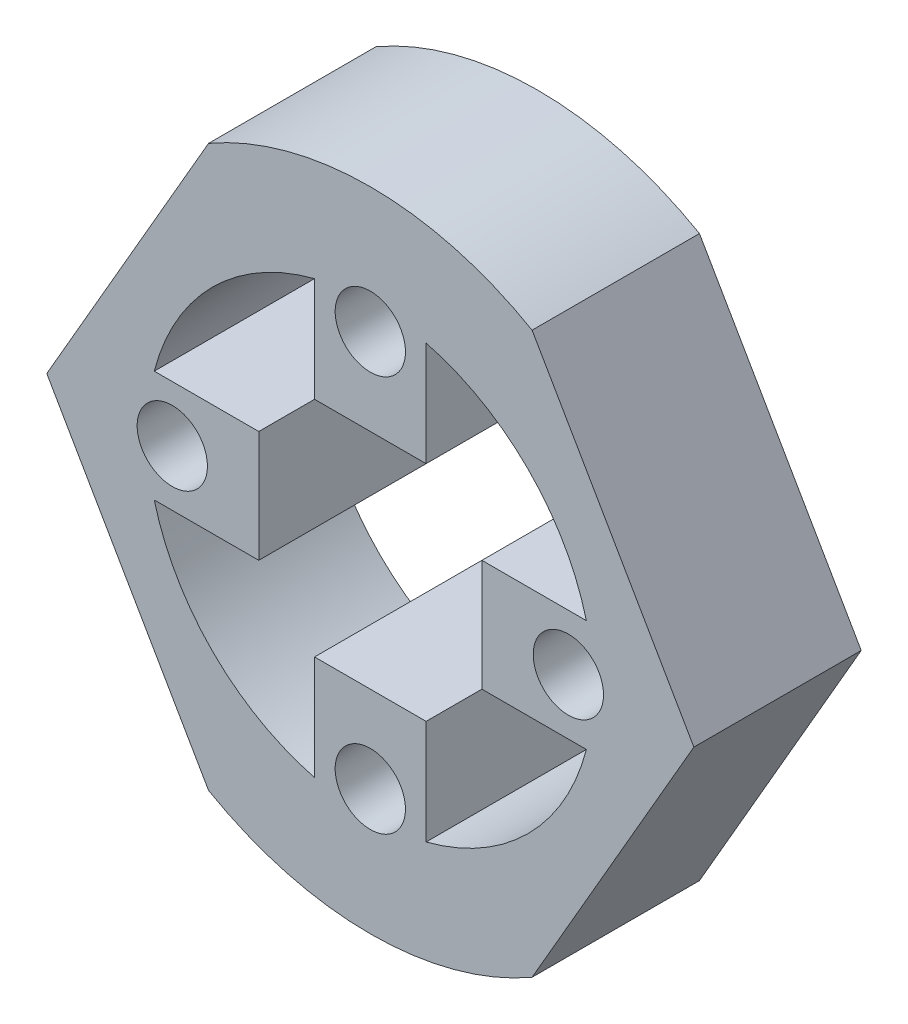
ISO-10303-21;
HEADER;
FILE_DESCRIPTION(('STEP AP214'),'2;1');
FILE_NAME('part.step','',(''),(''),'','','');
FILE_SCHEMA(('AUTOMOTIVE_DESIGN { 1 0 10303 214 1 1 1 1 }'));
ENDSEC;
DATA;
#1=APPLICATION_CONTEXT('core data for automotive mechanical design processes');
#2=APPLICATION_PROTOCOL_DEFINITION('international standard','automotive_design',2000,#1);
#3=PRODUCT_CONTEXT('',#1,'mechanical');
#4=PRODUCT('Part','Part','',(#3));
#5=PRODUCT_RELATED_PRODUCT_CATEGORY('part','',(#4));
#6=PRODUCT_DEFINITION_FORMATION('','',#4);
#7=PRODUCT_DEFINITION_CONTEXT('part definition',#1,'design');
#8=PRODUCT_DEFINITION('design','',#6,#7);
#9=PRODUCT_DEFINITION_SHAPE('','',#8);
#10=(LENGTH_UNIT() NAMED_UNIT(*) SI_UNIT(.MILLI.,.METRE.));
#11=(NAMED_UNIT(*) PLANE_ANGLE_UNIT() SI_UNIT($,.RADIAN.));
#12=(NAMED_UNIT(*) SI_UNIT($,.STERADIAN.) SOLID_ANGLE_UNIT());
#13=UNCERTAINTY_MEASURE_WITH_UNIT(LENGTH_MEASURE(1.E-05),#10,'distance_accuracy_value','');
#14=(GEOMETRIC_REPRESENTATION_CONTEXT(3) GLOBAL_UNCERTAINTY_ASSIGNED_CONTEXT((#13)) GLOBAL_UNIT_ASSIGNED_CONTEXT((#10,
#11,#12)) REPRESENTATION_CONTEXT('',''));
#15=CARTESIAN_POINT('',(0.,0.,0.));
#16=DIRECTION('',(0.,0.,1.));
#17=DIRECTION('',(1.,0.,0.));
#18=AXIS2_PLACEMENT_3D('',#15,#16,#17);
#19=CARTESIAN_POINT('',(0.,0.,-15.));
#20=DIRECTION('',(0.,0.,1.));
#21=DIRECTION('',(1.,0.,0.));
#22=AXIS2_PLACEMENT_3D('',#19,#20,#21);
#23=CYLINDRICAL_SURFACE('',#22,29.);
#24=CARTESIAN_POINT('',(0.,0.,-15.));
#25=DIRECTION('',(0.,0.,1.));
#26=DIRECTION('',(1.,0.,0.));
#27=AXIS2_PLACEMENT_3D('',#24,#25,#26);
#28=CIRCLE('',#27,29.);
#29=CARTESIAN_POINT('',(-14.5000000000003,-25.1147367097486,-15.));
#30=VERTEX_POINT('',#29);
#31=CARTESIAN_POINT('',(14.4999999999998,-25.1147367097489,-15.));
#32=VERTEX_POINT('',#31);
#33=EDGE_CURVE('E213',#30,#32,#28,.T.);
#34=ORIENTED_EDGE('',*,*,#33,.T.);
#35=DIRECTION('',(0.,0.,-1.));
#36=VECTOR('',#35,1.);
#37=CARTESIAN_POINT('',(14.4999999999998,-25.1147367097489,12.));
#38=LINE('',#37,#36);
#39=CARTESIAN_POINT('',(14.4999999999998,-25.1147367097489,0.));
#40=VERTEX_POINT('',#39);
#41=EDGE_CURVE('E195',#40,#32,#38,.T.);
#42=ORIENTED_EDGE('',*,*,#41,.F.);
#43=CARTESIAN_POINT('',(0.,0.,0.));
#44=DIRECTION('',(0.,0.,1.));
#45=DIRECTION('',(1.,0.,0.));
#46=AXIS2_PLACEMENT_3D('',#43,#44,#45);
#47=CIRCLE('',#46,29.);
#48=CARTESIAN_POINT('',(-14.5000000000003,-25.1147367097486,0.));
#49=VERTEX_POINT('',#48);
#50=EDGE_CURVE('E228',#49,#40,#47,.T.);
#51=ORIENTED_EDGE('',*,*,#50,.F.);
#52=DIRECTION('',(0.,0.,-1.));
#53=VECTOR('',#52,1.);
#54=CARTESIAN_POINT('',(-14.5000000000003,-25.1147367097486,12.));
#55=LINE('',#54,#53);
#56=EDGE_CURVE('E217',#49,#30,#55,.T.);
#57=ORIENTED_EDGE('',*,*,#56,.T.);
#58=EDGE_LOOP('',(#34,#42,#51,#57));
#59=FACE_BOUND('',#58,.T.);
#60=ADVANCED_FACE('F44',(#59),#23,.T.);
#61=CARTESIAN_POINT('',(0.,0.,-15.));
#62=DIRECTION('',(0.,0.,1.));
#63=DIRECTION('',(1.,0.,0.));
#64=AXIS2_PLACEMENT_3D('',#61,#62,#63);
#65=PLANE('',#64);
#66=CARTESIAN_POINT('',(0.,17.75,-15.));
#67=DIRECTION('',(0.,0.,1.));
#68=DIRECTION('',(1.,0.,0.));
#69=AXIS2_PLACEMENT_3D('',#66,#67,#68);
#70=CIRCLE('',#69,3.15);
#71=CARTESIAN_POINT('',(3.15,17.75,-15.));
#72=VERTEX_POINT('',#71);
#73=EDGE_CURVE('E263',#72,#72,#70,.F.);
#74=ORIENTED_EDGE('',*,*,#73,.F.);
#75=EDGE_LOOP('',(#74));
#76=FACE_BOUND('',#75,.T.);
#77=CARTESIAN_POINT('',(17.75,0.,-15.));
#78=DIRECTION('',(0.,0.,1.));
#79=DIRECTION('',(1.,0.,0.));
#80=AXIS2_PLACEMENT_3D('',#77,#78,#79);
#81=CIRCLE('',#80,3.15);
#82=CARTESIAN_POINT('',(20.9,0.,-15.));
#83=VERTEX_POINT('',#82);
#84=EDGE_CURVE('E250',#83,#83,#81,.F.);
#85=ORIENTED_EDGE('',*,*,#84,.F.);
#86=EDGE_LOOP('',(#85));
#87=FACE_BOUND('',#86,.T.);
#88=CARTESIAN_POINT('',(0.,-17.75,-15.));
#89=DIRECTION('',(0.,0.,1.));
#90=DIRECTION('',(1.,0.,0.));
#91=AXIS2_PLACEMENT_3D('',#88,#89,#90);
#92=CIRCLE('',#91,3.15);
#93=CARTESIAN_POINT('',(3.15,-17.75,-15.));
#94=VERTEX_POINT('',#93);
#95=EDGE_CURVE('E246',#94,#94,#92,.F.);
#96=ORIENTED_EDGE('',*,*,#95,.F.);
#97=EDGE_LOOP('',(#96));
#98=FACE_BOUND('',#97,.T.);
#99=CARTESIAN_POINT('',(-17.75,0.,-15.));
#100=DIRECTION('',(0.,0.,1.));
#101=DIRECTION('',(1.,0.,0.));
#102=AXIS2_PLACEMENT_3D('',#99,#100,#101);
#103=CIRCLE('',#102,3.15);
#104=CARTESIAN_POINT('',(-14.6,0.,-15.));
#105=VERTEX_POINT('',#104);
#106=EDGE_CURVE('E242',#105,#105,#103,.F.);
#107=ORIENTED_EDGE('',*,*,#106,.F.);
#108=EDGE_LOOP('',(#107));
#109=FACE_BOUND('',#108,.T.);
#110=CARTESIAN_POINT('',(0.,0.,-15.));
#111=DIRECTION('',(0.,0.,1.));
#112=DIRECTION('',(1.,0.,0.));
#113=AXIS2_PLACEMENT_3D('',#110,#111,#112);
#114=CIRCLE('',#113,20.);
#115=CARTESIAN_POINT('',(19.3649167310371,5.,-15.));
#116=VERTEX_POINT('',#115);
#117=CARTESIAN_POINT('',(5.,19.3649167310371,-15.));
#118=VERTEX_POINT('',#117);
#119=EDGE_CURVE('E235',#116,#118,#114,.T.);
#120=ORIENTED_EDGE('',*,*,#119,.T.);
#121=DIRECTION('',(0.,-1.,0.));
#122=VECTOR('',#121,1.);
#123=CARTESIAN_POINT('',(4.99999999999994,0.,-15.));
#124=LINE('',#123,#122);
#125=CARTESIAN_POINT('',(4.99999999999997,9.99999673103708,-15.));
#126=VERTEX_POINT('',#125);
#127=EDGE_CURVE('E369',#118,#126,#124,.T.);
#128=ORIENTED_EDGE('',*,*,#127,.T.);
#129=DIRECTION('',(1.,0.,0.));
#130=VECTOR('',#129,1.);
#131=CARTESIAN_POINT('',(0.,9.99999673103708,-15.));
#132=LINE('',#131,#130);
#133=CARTESIAN_POINT('',(-5.,9.99999673103708,-15.));
#134=VERTEX_POINT('',#133);
#135=EDGE_CURVE('E377',#134,#126,#132,.T.);
#136=ORIENTED_EDGE('',*,*,#135,.F.);
#137=DIRECTION('',(0.,-1.,0.));
#138=VECTOR('',#137,1.);
#139=CARTESIAN_POINT('',(-5.,0.,-15.));
#140=LINE('',#139,#138);
#141=CARTESIAN_POINT('',(-5.,19.3649167310371,-15.));
#142=VERTEX_POINT('',#141);
#143=EDGE_CURVE('E372',#142,#134,#140,.T.);
#144=ORIENTED_EDGE('',*,*,#143,.F.);
#145=CARTESIAN_POINT('',(-19.3649167310371,5.,-15.));
#146=VERTEX_POINT('',#145);
#147=EDGE_CURVE('E444',#142,#146,#114,.T.);
#148=ORIENTED_EDGE('',*,*,#147,.T.);
#149=DIRECTION('',(1.,0.,0.));
#150=VECTOR('',#149,1.);
#151=CARTESIAN_POINT('',(0.,5.00000000000001,-15.));
#152=LINE('',#151,#150);
#153=CARTESIAN_POINT('',(-9.99999673103708,5.,-15.));
#154=VERTEX_POINT('',#153);
#155=EDGE_CURVE('E341',#146,#154,#152,.T.);
#156=ORIENTED_EDGE('',*,*,#155,.T.);
#157=DIRECTION('',(0.,-1.,0.));
#158=VECTOR('',#157,1.);
#159=CARTESIAN_POINT('',(-9.99999673103708,0.,-15.));
#160=LINE('',#159,#158);
#161=CARTESIAN_POINT('',(-9.99999673103708,-5.,-15.));
#162=VERTEX_POINT('',#161);
#163=EDGE_CURVE('E337',#154,#162,#160,.T.);
#164=ORIENTED_EDGE('',*,*,#163,.T.);
#165=DIRECTION('',(1.,0.,0.));
#166=VECTOR('',#165,1.);
#167=CARTESIAN_POINT('',(0.,-5.,-15.));
#168=LINE('',#167,#166);
#169=CARTESIAN_POINT('',(-19.3649167310371,-5.,-15.));
#170=VERTEX_POINT('',#169);
#171=EDGE_CURVE('E333',#170,#162,#168,.T.);
#172=ORIENTED_EDGE('',*,*,#171,.F.);
#173=CARTESIAN_POINT('',(-5.,-19.3649167310371,-15.));
#174=VERTEX_POINT('',#173);
#175=EDGE_CURVE('E451',#170,#174,#114,.T.);
#176=ORIENTED_EDGE('',*,*,#175,.T.);
#177=DIRECTION('',(0.,1.,0.));
#178=VECTOR('',#177,1.);
#179=CARTESIAN_POINT('',(-5.,0.,-15.));
#180=LINE('',#179,#178);
#181=CARTESIAN_POINT('',(-5.,-9.99999673103708,-15.));
#182=VERTEX_POINT('',#181);
#183=EDGE_CURVE('E295',#174,#182,#180,.T.);
#184=ORIENTED_EDGE('',*,*,#183,.T.);
#185=DIRECTION('',(1.,0.,0.));
#186=VECTOR('',#185,1.);
#187=CARTESIAN_POINT('',(0.,-9.99999673103708,-15.));
#188=LINE('',#187,#186);
#189=CARTESIAN_POINT('',(5.,-9.99999673103708,-15.));
#190=VERTEX_POINT('',#189);
#191=EDGE_CURVE('E304',#182,#190,#188,.T.);
#192=ORIENTED_EDGE('',*,*,#191,.T.);
#193=DIRECTION('',(0.,1.,0.));
#194=VECTOR('',#193,1.);
#195=CARTESIAN_POINT('',(4.99999999999999,0.,-15.));
#196=LINE('',#195,#194);
#197=CARTESIAN_POINT('',(5.,-19.3649167310371,-15.));
#198=VERTEX_POINT('',#197);
#199=EDGE_CURVE('E299',#198,#190,#196,.T.);
#200=ORIENTED_EDGE('',*,*,#199,.F.);
#201=CARTESIAN_POINT('',(19.3649167310371,-5.,-15.));
#202=VERTEX_POINT('',#201);
#203=EDGE_CURVE('E445',#198,#202,#114,.T.);
#204=ORIENTED_EDGE('',*,*,#203,.T.);
#205=DIRECTION('',(-1.,0.,0.));
#206=VECTOR('',#205,1.);
#207=CARTESIAN_POINT('',(0.,-5.00000000000002,-15.));
#208=LINE('',#207,#206);
#209=CARTESIAN_POINT('',(9.99999673103709,-5.00000000000001,-15.));
#210=VERTEX_POINT('',#209);
#211=EDGE_CURVE('E406',#202,#210,#208,.T.);
#212=ORIENTED_EDGE('',*,*,#211,.T.);
#213=DIRECTION('',(0.,-1.,0.));
#214=VECTOR('',#213,1.);
#215=CARTESIAN_POINT('',(9.99999673103709,0.,-15.));
#216=LINE('',#215,#214);
#217=CARTESIAN_POINT('',(9.99999673103709,5.00000000000001,-15.));
#218=VERTEX_POINT('',#217);
#219=EDGE_CURVE('E414',#218,#210,#216,.T.);
#220=ORIENTED_EDGE('',*,*,#219,.F.);
#221=DIRECTION('',(-1.,0.,0.));
#222=VECTOR('',#221,1.);
#223=CARTESIAN_POINT('',(0.,5.00000000000002,-15.));
#224=LINE('',#223,#222);
#225=EDGE_CURVE('E409',#116,#218,#224,.T.);
#226=ORIENTED_EDGE('',*,*,#225,.F.);
#227=EDGE_LOOP('',(#120,#128,#136,#144,#148,#156,#164,#172,#176,#184,#192,#200,#204,#212,#220,#226));
#228=FACE_BOUND('',#227,.T.);
#229=DIRECTION('',(-0.500000000000007,-0.866025403784435,0.));
#230=VECTOR('',#229,1.);
#231=CARTESIAN_POINT('',(21.7499999999999,-12.5573683548745,-15.));
#232=LINE('',#231,#230);
#233=CARTESIAN_POINT('',(29.,-1.97758476261356E-13,-15.));
#234=VERTEX_POINT('',#233);
#235=EDGE_CURVE('E198',#234,#32,#232,.T.);
#236=ORIENTED_EDGE('',*,*,#235,.T.);
#237=ORIENTED_EDGE('',*,*,#33,.F.);
#238=DIRECTION('',(-0.499999999999995,0.866025403784442,0.));
#239=VECTOR('',#238,1.);
#240=CARTESIAN_POINT('',(-21.7500000000001,-12.5573683548743,-15.));
#241=LINE('',#240,#239);
#242=CARTESIAN_POINT('',(-29.,0.,-15.));
#243=VERTEX_POINT('',#242);
#244=EDGE_CURVE('E266',#30,#243,#241,.T.);
#245=ORIENTED_EDGE('',*,*,#244,.T.);
#246=DIRECTION('',(0.500000000000001,0.866025403784438,0.));
#247=VECTOR('',#246,1.);
#248=CARTESIAN_POINT('',(-21.75,12.5573683548744,-15.));
#249=LINE('',#248,#247);
#250=CARTESIAN_POINT('',(-14.4999999999999,25.1147367097488,-15.));
#251=VERTEX_POINT('',#250);
#252=EDGE_CURVE('E290',#243,#251,#249,.T.);
#253=ORIENTED_EDGE('',*,*,#252,.T.);
#254=CARTESIAN_POINT('',(14.5000000000001,25.1147367097487,-15.));
#255=VERTEX_POINT('',#254);
#256=EDGE_CURVE('E221',#255,#251,#28,.T.);
#257=ORIENTED_EDGE('',*,*,#256,.F.);
#258=DIRECTION('',(-0.499999999999995,0.866025403784442,0.));
#259=VECTOR('',#258,1.);
#260=CARTESIAN_POINT('',(21.7500000000001,12.5573683548742,-15.));
#261=LINE('',#260,#259);
#262=EDGE_CURVE('E215',#234,#255,#261,.T.);
#263=ORIENTED_EDGE('',*,*,#262,.F.);
#264=EDGE_LOOP('',(#236,#237,#245,#253,#257,#263));
#265=FACE_BOUND('',#264,.T.);
#266=ADVANCED_FACE('F211',(#76,#87,#98,#109,#228,#265),#65,.F.);
#267=CARTESIAN_POINT('',(0.,0.,0.));
#268=DIRECTION('',(0.,0.,1.));
#269=DIRECTION('',(1.,0.,0.));
#270=AXIS2_PLACEMENT_3D('',#267,#268,#269);
#271=PLANE('',#270);
#272=CARTESIAN_POINT('',(0.,17.75,0.));
#273=DIRECTION('',(0.,0.,1.));
#274=DIRECTION('',(1.,0.,0.));
#275=AXIS2_PLACEMENT_3D('',#272,#273,#274);
#276=CIRCLE('',#275,3.15);
#277=CARTESIAN_POINT('',(3.15,17.75,0.));
#278=VERTEX_POINT('',#277);
#279=EDGE_CURVE('E48',#278,#278,#276,.F.);
#280=ORIENTED_EDGE('',*,*,#279,.T.);
#281=EDGE_LOOP('',(#280));
#282=FACE_BOUND('',#281,.T.);
#283=CARTESIAN_POINT('',(17.75,0.,0.));
#284=DIRECTION('',(0.,0.,1.));
#285=DIRECTION('',(1.,0.,0.));
#286=AXIS2_PLACEMENT_3D('',#283,#284,#285);
#287=CIRCLE('',#286,3.15);
#288=CARTESIAN_POINT('',(20.9,0.,0.));
#289=VERTEX_POINT('',#288);
#290=EDGE_CURVE('E247',#289,#289,#287,.F.);
#291=ORIENTED_EDGE('',*,*,#290,.T.);
#292=EDGE_LOOP('',(#291));
#293=FACE_BOUND('',#292,.T.);
#294=CARTESIAN_POINT('',(0.,-17.75,0.));
#295=DIRECTION('',(0.,0.,1.));
#296=DIRECTION('',(1.,0.,0.));
#297=AXIS2_PLACEMENT_3D('',#294,#295,#296);
#298=CIRCLE('',#297,3.15);
#299=CARTESIAN_POINT('',(3.15,-17.75,0.));
#300=VERTEX_POINT('',#299);
#301=EDGE_CURVE('E243',#300,#300,#298,.F.);
#302=ORIENTED_EDGE('',*,*,#301,.T.);
#303=EDGE_LOOP('',(#302));
#304=FACE_BOUND('',#303,.T.);
#305=CARTESIAN_POINT('',(-17.75,0.,0.));
#306=DIRECTION('',(0.,0.,1.));
#307=DIRECTION('',(1.,0.,0.));
#308=AXIS2_PLACEMENT_3D('',#305,#306,#307);
#309=CIRCLE('',#308,3.15);
#310=CARTESIAN_POINT('',(-14.6,0.,0.));
#311=VERTEX_POINT('',#310);
#312=EDGE_CURVE('E238',#311,#311,#309,.F.);
#313=ORIENTED_EDGE('',*,*,#312,.T.);
#314=EDGE_LOOP('',(#313));
#315=FACE_BOUND('',#314,.T.);
#316=CARTESIAN_POINT('',(0.,0.,0.));
#317=DIRECTION('',(0.,0.,1.));
#318=DIRECTION('',(1.,0.,0.));
#319=AXIS2_PLACEMENT_3D('',#316,#317,#318);
#320=CIRCLE('',#319,20.);
#321=CARTESIAN_POINT('',(19.3649167310371,5.,0.));
#322=VERTEX_POINT('',#321);
#323=CARTESIAN_POINT('',(5.,19.3649167310371,0.));
#324=VERTEX_POINT('',#323);
#325=EDGE_CURVE('E231',#322,#324,#320,.T.);
#326=ORIENTED_EDGE('',*,*,#325,.F.);
#327=DIRECTION('',(-1.,0.,0.));
#328=VECTOR('',#327,1.);
#329=CARTESIAN_POINT('',(0.,5.00000000000002,0.));
#330=LINE('',#329,#328);
#331=CARTESIAN_POINT('',(9.99999673103709,5.00000000000001,0.));
#332=VERTEX_POINT('',#331);
#333=EDGE_CURVE('E422',#322,#332,#330,.T.);
#334=ORIENTED_EDGE('',*,*,#333,.T.);
#335=DIRECTION('',(0.,-1.,0.));
#336=VECTOR('',#335,1.);
#337=CARTESIAN_POINT('',(9.99999673103709,0.,0.));
#338=LINE('',#337,#336);
#339=CARTESIAN_POINT('',(9.99999673103709,-5.00000000000001,0.));
#340=VERTEX_POINT('',#339);
#341=EDGE_CURVE('E410',#332,#340,#338,.T.);
#342=ORIENTED_EDGE('',*,*,#341,.T.);
#343=DIRECTION('',(-1.,0.,0.));
#344=VECTOR('',#343,1.);
#345=CARTESIAN_POINT('',(0.,-5.00000000000002,0.));
#346=LINE('',#345,#344);
#347=CARTESIAN_POINT('',(19.3649167310371,-5.,0.));
#348=VERTEX_POINT('',#347);
#349=EDGE_CURVE('E395',#348,#340,#346,.T.);
#350=ORIENTED_EDGE('',*,*,#349,.F.);
#351=CARTESIAN_POINT('',(5.,-19.3649167310371,0.));
#352=VERTEX_POINT('',#351);
#353=EDGE_CURVE('E432',#352,#348,#320,.T.);
#354=ORIENTED_EDGE('',*,*,#353,.F.);
#355=DIRECTION('',(0.,1.,0.));
#356=VECTOR('',#355,1.);
#357=CARTESIAN_POINT('',(4.99999999999999,0.,0.));
#358=LINE('',#357,#356);
#359=CARTESIAN_POINT('',(5.,-9.99999673103708,0.));
#360=VERTEX_POINT('',#359);
#361=EDGE_CURVE('E311',#352,#360,#358,.T.);
#362=ORIENTED_EDGE('',*,*,#361,.T.);
#363=DIRECTION('',(1.,0.,0.));
#364=VECTOR('',#363,1.);
#365=CARTESIAN_POINT('',(0.,-9.99999673103708,0.));
#366=LINE('',#365,#364);
#367=CARTESIAN_POINT('',(-5.,-9.99999673103708,0.));
#368=VERTEX_POINT('',#367);
#369=EDGE_CURVE('E300',#368,#360,#366,.T.);
#370=ORIENTED_EDGE('',*,*,#369,.F.);
#371=DIRECTION('',(0.,1.,0.));
#372=VECTOR('',#371,1.);
#373=CARTESIAN_POINT('',(-5.,0.,0.));
#374=LINE('',#373,#372);
#375=CARTESIAN_POINT('',(-5.,-19.3649167310371,0.));
#376=VERTEX_POINT('',#375);
#377=EDGE_CURVE('E294',#376,#368,#374,.T.);
#378=ORIENTED_EDGE('',*,*,#377,.F.);
#379=CARTESIAN_POINT('',(-19.3649167310371,-5.,0.));
#380=VERTEX_POINT('',#379);
#381=EDGE_CURVE('E461',#380,#376,#320,.T.);
#382=ORIENTED_EDGE('',*,*,#381,.F.);
#383=DIRECTION('',(1.,0.,0.));
#384=VECTOR('',#383,1.);
#385=CARTESIAN_POINT('',(0.,-5.,0.));
#386=LINE('',#385,#384);
#387=CARTESIAN_POINT('',(-9.99999673103708,-5.,0.));
#388=VERTEX_POINT('',#387);
#389=EDGE_CURVE('E322',#380,#388,#386,.T.);
#390=ORIENTED_EDGE('',*,*,#389,.T.);
#391=DIRECTION('',(0.,-1.,0.));
#392=VECTOR('',#391,1.);
#393=CARTESIAN_POINT('',(-9.99999673103708,0.,0.));
#394=LINE('',#393,#392);
#395=CARTESIAN_POINT('',(-9.99999673103708,5.,0.));
#396=VERTEX_POINT('',#395);
#397=EDGE_CURVE('E348',#396,#388,#394,.T.);
#398=ORIENTED_EDGE('',*,*,#397,.F.);
#399=DIRECTION('',(1.,0.,0.));
#400=VECTOR('',#399,1.);
#401=CARTESIAN_POINT('',(0.,5.00000000000001,0.));
#402=LINE('',#401,#400);
#403=CARTESIAN_POINT('',(-19.3649167310371,5.,0.));
#404=VERTEX_POINT('',#403);
#405=EDGE_CURVE('E338',#404,#396,#402,.T.);
#406=ORIENTED_EDGE('',*,*,#405,.F.);
#407=CARTESIAN_POINT('',(-5.,19.3649167310371,0.));
#408=VERTEX_POINT('',#407);
#409=EDGE_CURVE('E458',#408,#404,#320,.T.);
#410=ORIENTED_EDGE('',*,*,#409,.F.);
#411=DIRECTION('',(0.,-1.,0.));
#412=VECTOR('',#411,1.);
#413=CARTESIAN_POINT('',(-5.,0.,0.));
#414=LINE('',#413,#412);
#415=CARTESIAN_POINT('',(-5.,9.99999673103708,0.));
#416=VERTEX_POINT('',#415);
#417=EDGE_CURVE('E385',#408,#416,#414,.T.);
#418=ORIENTED_EDGE('',*,*,#417,.T.);
#419=DIRECTION('',(1.,0.,0.));
#420=VECTOR('',#419,1.);
#421=CARTESIAN_POINT('',(0.,9.99999673103708,0.));
#422=LINE('',#421,#420);
#423=CARTESIAN_POINT('',(4.99999999999997,9.99999673103708,0.));
#424=VERTEX_POINT('',#423);
#425=EDGE_CURVE('E373',#416,#424,#422,.T.);
#426=ORIENTED_EDGE('',*,*,#425,.T.);
#427=DIRECTION('',(0.,-1.,0.));
#428=VECTOR('',#427,1.);
#429=CARTESIAN_POINT('',(4.99999999999994,0.,0.));
#430=LINE('',#429,#428);
#431=EDGE_CURVE('E358',#324,#424,#430,.T.);
#432=ORIENTED_EDGE('',*,*,#431,.F.);
#433=EDGE_LOOP('',(#326,#334,#342,#350,#354,#362,#370,#378,#382,#390,#398,#406,#410,#418,#426,#432));
#434=FACE_BOUND('',#433,.T.);
#435=ORIENTED_EDGE('',*,*,#50,.T.);
#436=DIRECTION('',(0.500000000000007,0.866025403784435,0.));
#437=VECTOR('',#436,1.);
#438=CARTESIAN_POINT('',(21.7499999999999,-12.5573683548745,0.));
#439=LINE('',#438,#437);
#440=CARTESIAN_POINT('',(29.,-1.97758476261356E-13,0.));
#441=VERTEX_POINT('',#440);
#442=EDGE_CURVE('E201',#40,#441,#439,.T.);
#443=ORIENTED_EDGE('',*,*,#442,.T.);
#444=DIRECTION('',(-0.499999999999995,0.866025403784442,0.));
#445=VECTOR('',#444,1.);
#446=CARTESIAN_POINT('',(21.7500000000001,12.5573683548742,0.));
#447=LINE('',#446,#445);
#448=CARTESIAN_POINT('',(14.5000000000001,25.1147367097487,0.));
#449=VERTEX_POINT('',#448);
#450=EDGE_CURVE('E54',#441,#449,#447,.T.);
#451=ORIENTED_EDGE('',*,*,#450,.T.);
#452=CARTESIAN_POINT('',(-14.4999999999999,25.1147367097488,0.));
#453=VERTEX_POINT('',#452);
#454=EDGE_CURVE('E222',#449,#453,#47,.T.);
#455=ORIENTED_EDGE('',*,*,#454,.T.);
#456=DIRECTION('',(0.500000000000001,0.866025403784438,0.));
#457=VECTOR('',#456,1.);
#458=CARTESIAN_POINT('',(-21.75,12.5573683548744,0.));
#459=LINE('',#458,#457);
#460=CARTESIAN_POINT('',(-29.,0.,0.));
#461=VERTEX_POINT('',#460);
#462=EDGE_CURVE('E11',#461,#453,#459,.T.);
#463=ORIENTED_EDGE('',*,*,#462,.F.);
#464=DIRECTION('',(0.499999999999995,-0.866025403784441,0.));
#465=VECTOR('',#464,1.);
#466=CARTESIAN_POINT('',(-21.7500000000001,-12.5573683548743,0.));
#467=LINE('',#466,#465);
#468=EDGE_CURVE('E62',#461,#49,#467,.T.);
#469=ORIENTED_EDGE('',*,*,#468,.T.);
#470=EDGE_LOOP('',(#435,#443,#451,#455,#463,#469));
#471=FACE_BOUND('',#470,.T.);
#472=ADVANCED_FACE('F475',(#282,#293,#304,#315,#434,#471),#271,.T.);
#473=DIRECTION('',(0.,0.,1.));
#474=VECTOR('',#473,1.);
#475=CARTESIAN_POINT('',(-14.4999999999999,25.1147367097488,-31.));
#476=LINE('',#475,#474);
#477=EDGE_CURVE('E279',#251,#453,#476,.T.);
#478=ORIENTED_EDGE('',*,*,#477,.T.);
#479=ORIENTED_EDGE('',*,*,#454,.F.);
#480=DIRECTION('',(0.,0.,-1.));
#481=VECTOR('',#480,1.);
#482=CARTESIAN_POINT('',(14.5000000000001,25.1147367097487,12.));
#483=LINE('',#482,#481);
#484=EDGE_CURVE('E70',#449,#255,#483,.T.);
#485=ORIENTED_EDGE('',*,*,#484,.T.);
#486=ORIENTED_EDGE('',*,*,#256,.T.);
#487=EDGE_LOOP('',(#478,#479,#485,#486));
#488=FACE_BOUND('',#487,.T.);
#489=ADVANCED_FACE('F46',(#488),#23,.T.);
#490=CARTESIAN_POINT('',(0.,0.,-15.));
#491=DIRECTION('',(0.,0.,1.));
#492=DIRECTION('',(1.,0.,0.));
#493=AXIS2_PLACEMENT_3D('',#490,#491,#492);
#494=CYLINDRICAL_SURFACE('',#493,20.);
#495=DIRECTION('',(0.,0.,1.));
#496=VECTOR('',#495,1.);
#497=CARTESIAN_POINT('',(-5.,-19.3649167310371,-15.));
#498=LINE('',#497,#496);
#499=EDGE_CURVE('E307',#174,#376,#498,.T.);
#500=ORIENTED_EDGE('',*,*,#499,.F.);
#501=ORIENTED_EDGE('',*,*,#175,.F.);
#502=DIRECTION('',(0.,0.,1.));
#503=VECTOR('',#502,1.);
#504=CARTESIAN_POINT('',(-19.3649167310371,-5.,-15.));
#505=LINE('',#504,#503);
#506=EDGE_CURVE('E344',#170,#380,#505,.T.);
#507=ORIENTED_EDGE('',*,*,#506,.T.);
#508=ORIENTED_EDGE('',*,*,#381,.T.);
#509=EDGE_LOOP('',(#500,#501,#507,#508));
#510=FACE_BOUND('',#509,.T.);
#511=ADVANCED_FACE('F466',(#510),#494,.F.);
#512=DIRECTION('',(0.,0.,1.));
#513=VECTOR('',#512,1.);
#514=CARTESIAN_POINT('',(-19.3649167310371,5.,-15.));
#515=LINE('',#514,#513);
#516=EDGE_CURVE('E354',#146,#404,#515,.T.);
#517=ORIENTED_EDGE('',*,*,#516,.F.);
#518=ORIENTED_EDGE('',*,*,#147,.F.);
#519=DIRECTION('',(0.,0.,1.));
#520=VECTOR('',#519,1.);
#521=CARTESIAN_POINT('',(-5.,19.3649167310371,-15.));
#522=LINE('',#521,#520);
#523=EDGE_CURVE('E399',#142,#408,#522,.T.);
#524=ORIENTED_EDGE('',*,*,#523,.T.);
#525=ORIENTED_EDGE('',*,*,#409,.T.);
#526=EDGE_LOOP('',(#517,#518,#524,#525));
#527=FACE_BOUND('',#526,.T.);
#528=ADVANCED_FACE('F495',(#527),#494,.F.);
#529=DIRECTION('',(0.,0.,1.));
#530=VECTOR('',#529,1.);
#531=CARTESIAN_POINT('',(5.,19.3649167310371,-15.));
#532=LINE('',#531,#530);
#533=EDGE_CURVE('E381',#118,#324,#532,.T.);
#534=ORIENTED_EDGE('',*,*,#533,.F.);
#535=ORIENTED_EDGE('',*,*,#119,.F.);
#536=DIRECTION('',(0.,0.,1.));
#537=VECTOR('',#536,1.);
#538=CARTESIAN_POINT('',(19.3649167310371,5.,-15.));
#539=LINE('',#538,#537);
#540=EDGE_CURVE('E436',#116,#322,#539,.T.);
#541=ORIENTED_EDGE('',*,*,#540,.T.);
#542=ORIENTED_EDGE('',*,*,#325,.T.);
#543=EDGE_LOOP('',(#534,#535,#541,#542));
#544=FACE_BOUND('',#543,.T.);
#545=ADVANCED_FACE('F512',(#544),#494,.F.);
#546=ORIENTED_EDGE('',*,*,#203,.F.);
#547=DIRECTION('',(0.,0.,1.));
#548=VECTOR('',#547,1.);
#549=CARTESIAN_POINT('',(5.,-19.3649167310371,-15.));
#550=LINE('',#549,#548);
#551=EDGE_CURVE('E326',#198,#352,#550,.T.);
#552=ORIENTED_EDGE('',*,*,#551,.T.);
#553=ORIENTED_EDGE('',*,*,#353,.T.);
#554=DIRECTION('',(0.,0.,1.));
#555=VECTOR('',#554,1.);
#556=CARTESIAN_POINT('',(19.3649167310371,-5.,-15.));
#557=LINE('',#556,#555);
#558=EDGE_CURVE('E418',#202,#348,#557,.T.);
#559=ORIENTED_EDGE('',*,*,#558,.F.);
#560=EDGE_LOOP('',(#546,#552,#553,#559));
#561=FACE_BOUND('',#560,.T.);
#562=ADVANCED_FACE('F523',(#561),#494,.F.);
#563=CARTESIAN_POINT('',(0.,-5.00000000000002,-15.));
#564=DIRECTION('',(0.,1.,0.));
#565=DIRECTION('',(-1.,0.,0.));
#566=AXIS2_PLACEMENT_3D('',#563,#564,#565);
#567=PLANE('',#566);
#568=ORIENTED_EDGE('',*,*,#349,.T.);
#569=DIRECTION('',(0.,0.,1.));
#570=VECTOR('',#569,1.);
#571=CARTESIAN_POINT('',(9.99999673103709,-5.00000000000001,-15.));
#572=LINE('',#571,#570);
#573=EDGE_CURVE('E429',#210,#340,#572,.T.);
#574=ORIENTED_EDGE('',*,*,#573,.F.);
#575=ORIENTED_EDGE('',*,*,#211,.F.);
#576=ORIENTED_EDGE('',*,*,#558,.T.);
#577=EDGE_LOOP('',(#568,#574,#575,#576));
#578=FACE_BOUND('',#577,.T.);
#579=ADVANCED_FACE('F521',(#578),#567,.F.);
#580=CARTESIAN_POINT('',(9.99999673103709,0.,-15.));
#581=DIRECTION('',(-1.,0.,0.));
#582=DIRECTION('',(0.,-1.,0.));
#583=AXIS2_PLACEMENT_3D('',#580,#581,#582);
#584=PLANE('',#583);
#585=ORIENTED_EDGE('',*,*,#341,.F.);
#586=DIRECTION('',(0.,0.,1.));
#587=VECTOR('',#586,1.);
#588=CARTESIAN_POINT('',(9.99999673103709,5.00000000000001,-15.));
#589=LINE('',#588,#587);
#590=EDGE_CURVE('E433',#218,#332,#589,.T.);
#591=ORIENTED_EDGE('',*,*,#590,.F.);
#592=ORIENTED_EDGE('',*,*,#219,.T.);
#593=ORIENTED_EDGE('',*,*,#573,.T.);
#594=EDGE_LOOP('',(#585,#591,#592,#593));
#595=FACE_BOUND('',#594,.T.);
#596=ADVANCED_FACE('F517',(#595),#584,.T.);
#597=CARTESIAN_POINT('',(0.,5.00000000000002,-15.));
#598=DIRECTION('',(0.,1.,0.));
#599=DIRECTION('',(-1.,0.,0.));
#600=AXIS2_PLACEMENT_3D('',#597,#598,#599);
#601=PLANE('',#600);
#602=ORIENTED_EDGE('',*,*,#333,.F.);
#603=ORIENTED_EDGE('',*,*,#540,.F.);
#604=ORIENTED_EDGE('',*,*,#225,.T.);
#605=ORIENTED_EDGE('',*,*,#590,.T.);
#606=EDGE_LOOP('',(#602,#603,#604,#605));
#607=FACE_BOUND('',#606,.T.);
#608=ADVANCED_FACE('F514',(#607),#601,.T.);
#609=CARTESIAN_POINT('',(4.99999999999994,0.,-15.));
#610=DIRECTION('',(-1.,0.,0.));
#611=DIRECTION('',(0.,-1.,0.));
#612=AXIS2_PLACEMENT_3D('',#609,#610,#611);
#613=PLANE('',#612);
#614=ORIENTED_EDGE('',*,*,#431,.T.);
#615=DIRECTION('',(0.,0.,1.));
#616=VECTOR('',#615,1.);
#617=CARTESIAN_POINT('',(4.99999999999997,9.99999673103708,-15.));
#618=LINE('',#617,#616);
#619=EDGE_CURVE('E392',#126,#424,#618,.T.);
#620=ORIENTED_EDGE('',*,*,#619,.F.);
#621=ORIENTED_EDGE('',*,*,#127,.F.);
#622=ORIENTED_EDGE('',*,*,#533,.T.);
#623=EDGE_LOOP('',(#614,#620,#621,#622));
#624=FACE_BOUND('',#623,.T.);
#625=ADVANCED_FACE('F508',(#624),#613,.F.);
#626=CARTESIAN_POINT('',(0.,9.99999673103708,-15.));
#627=DIRECTION('',(0.,-1.,0.));
#628=DIRECTION('',(0.,0.,-1.));
#629=AXIS2_PLACEMENT_3D('',#626,#627,#628);
#630=PLANE('',#629);
#631=ORIENTED_EDGE('',*,*,#425,.F.);
#632=DIRECTION('',(0.,0.,1.));
#633=VECTOR('',#632,1.);
#634=CARTESIAN_POINT('',(-5.,9.99999673103708,-15.));
#635=LINE('',#634,#633);
#636=EDGE_CURVE('E396',#134,#416,#635,.T.);
#637=ORIENTED_EDGE('',*,*,#636,.F.);
#638=ORIENTED_EDGE('',*,*,#135,.T.);
#639=ORIENTED_EDGE('',*,*,#619,.T.);
#640=EDGE_LOOP('',(#631,#637,#638,#639));
#641=FACE_BOUND('',#640,.T.);
#642=ADVANCED_FACE('F505',(#641),#630,.T.);
#643=CARTESIAN_POINT('',(-5.,0.,-15.));
#644=DIRECTION('',(-1.,0.,0.));
#645=DIRECTION('',(0.,-1.,0.));
#646=AXIS2_PLACEMENT_3D('',#643,#644,#645);
#647=PLANE('',#646);
#648=ORIENTED_EDGE('',*,*,#417,.F.);
#649=ORIENTED_EDGE('',*,*,#523,.F.);
#650=ORIENTED_EDGE('',*,*,#143,.T.);
#651=ORIENTED_EDGE('',*,*,#636,.T.);
#652=EDGE_LOOP('',(#648,#649,#650,#651));
#653=FACE_BOUND('',#652,.T.);
#654=ADVANCED_FACE('F501',(#653),#647,.T.);
#655=CARTESIAN_POINT('',(0.,5.00000000000001,-15.));
#656=DIRECTION('',(0.,-1.,0.));
#657=DIRECTION('',(1.,0.,0.));
#658=AXIS2_PLACEMENT_3D('',#655,#656,#657);
#659=PLANE('',#658);
#660=ORIENTED_EDGE('',*,*,#405,.T.);
#661=DIRECTION('',(0.,0.,1.));
#662=VECTOR('',#661,1.);
#663=CARTESIAN_POINT('',(-9.99999673103708,5.,-15.));
#664=LINE('',#663,#662);
#665=EDGE_CURVE('E359',#154,#396,#664,.T.);
#666=ORIENTED_EDGE('',*,*,#665,.F.);
#667=ORIENTED_EDGE('',*,*,#155,.F.);
#668=ORIENTED_EDGE('',*,*,#516,.T.);
#669=EDGE_LOOP('',(#660,#666,#667,#668));
#670=FACE_BOUND('',#669,.T.);
#671=ADVANCED_FACE('F493',(#670),#659,.F.);
#672=CARTESIAN_POINT('',(-9.99999673103708,0.,-15.));
#673=DIRECTION('',(-1.,0.,0.));
#674=DIRECTION('',(0.,-1.,0.));
#675=AXIS2_PLACEMENT_3D('',#672,#673,#674);
#676=PLANE('',#675);
#677=ORIENTED_EDGE('',*,*,#397,.T.);
#678=DIRECTION('',(0.,0.,1.));
#679=VECTOR('',#678,1.);
#680=CARTESIAN_POINT('',(-9.99999673103708,-5.,-15.));
#681=LINE('',#680,#679);
#682=EDGE_CURVE('E363',#162,#388,#681,.T.);
#683=ORIENTED_EDGE('',*,*,#682,.F.);
#684=ORIENTED_EDGE('',*,*,#163,.F.);
#685=ORIENTED_EDGE('',*,*,#665,.T.);
#686=EDGE_LOOP('',(#677,#683,#684,#685));
#687=FACE_BOUND('',#686,.T.);
#688=ADVANCED_FACE('F488',(#687),#676,.F.);
#689=CARTESIAN_POINT('',(0.,-5.,-15.));
#690=DIRECTION('',(0.,-1.,0.));
#691=DIRECTION('',(1.,0.,0.));
#692=AXIS2_PLACEMENT_3D('',#689,#690,#691);
#693=PLANE('',#692);
#694=ORIENTED_EDGE('',*,*,#389,.F.);
#695=ORIENTED_EDGE('',*,*,#506,.F.);
#696=ORIENTED_EDGE('',*,*,#171,.T.);
#697=ORIENTED_EDGE('',*,*,#682,.T.);
#698=EDGE_LOOP('',(#694,#695,#696,#697));
#699=FACE_BOUND('',#698,.T.);
#700=ADVANCED_FACE('F483',(#699),#693,.T.);
#701=CARTESIAN_POINT('',(-5.,0.,-15.));
#702=DIRECTION('',(1.,0.,0.));
#703=DIRECTION('',(0.,1.,0.));
#704=AXIS2_PLACEMENT_3D('',#701,#702,#703);
#705=PLANE('',#704);
#706=ORIENTED_EDGE('',*,*,#377,.T.);
#707=DIRECTION('',(0.,0.,1.));
#708=VECTOR('',#707,1.);
#709=CARTESIAN_POINT('',(-5.,-9.99999673103708,-15.));
#710=LINE('',#709,#708);
#711=EDGE_CURVE('E318',#182,#368,#710,.T.);
#712=ORIENTED_EDGE('',*,*,#711,.F.);
#713=ORIENTED_EDGE('',*,*,#183,.F.);
#714=ORIENTED_EDGE('',*,*,#499,.T.);
#715=EDGE_LOOP('',(#706,#712,#713,#714));
#716=FACE_BOUND('',#715,.T.);
#717=ADVANCED_FACE('F473',(#716),#705,.F.);
#718=CARTESIAN_POINT('',(0.,-9.99999673103708,-15.));
#719=DIRECTION('',(0.,-1.,0.));
#720=DIRECTION('',(0.,0.,-1.));
#721=AXIS2_PLACEMENT_3D('',#718,#719,#720);
#722=PLANE('',#721);
#723=ORIENTED_EDGE('',*,*,#369,.T.);
#724=DIRECTION('',(0.,0.,1.));
#725=VECTOR('',#724,1.);
#726=CARTESIAN_POINT('',(5.,-9.99999673103708,-15.));
#727=LINE('',#726,#725);
#728=EDGE_CURVE('E323',#190,#360,#727,.T.);
#729=ORIENTED_EDGE('',*,*,#728,.F.);
#730=ORIENTED_EDGE('',*,*,#191,.F.);
#731=ORIENTED_EDGE('',*,*,#711,.T.);
#732=EDGE_LOOP('',(#723,#729,#730,#731));
#733=FACE_BOUND('',#732,.T.);
#734=ADVANCED_FACE('F480',(#733),#722,.F.);
#735=CARTESIAN_POINT('',(4.99999999999999,0.,-15.));
#736=DIRECTION('',(1.,0.,0.));
#737=DIRECTION('',(0.,1.,0.));
#738=AXIS2_PLACEMENT_3D('',#735,#736,#737);
#739=PLANE('',#738);
#740=ORIENTED_EDGE('',*,*,#361,.F.);
#741=ORIENTED_EDGE('',*,*,#551,.F.);
#742=ORIENTED_EDGE('',*,*,#199,.T.);
#743=ORIENTED_EDGE('',*,*,#728,.T.);
#744=EDGE_LOOP('',(#740,#741,#742,#743));
#745=FACE_BOUND('',#744,.T.);
#746=ADVANCED_FACE('F526',(#745),#739,.T.);
#747=CARTESIAN_POINT('',(21.7500000000001,12.5573683548742,12.));
#748=DIRECTION('',(0.866025403784441,0.499999999999995,0.));
#749=DIRECTION('',(-0.499999999999995,0.866025403784442,0.));
#750=AXIS2_PLACEMENT_3D('',#747,#748,#749);
#751=PLANE('',#750);
#752=ORIENTED_EDGE('',*,*,#262,.T.);
#753=ORIENTED_EDGE('',*,*,#484,.F.);
#754=ORIENTED_EDGE('',*,*,#450,.F.);
#755=DIRECTION('',(0.,0.,-1.));
#756=VECTOR('',#755,1.);
#757=CARTESIAN_POINT('',(29.,-1.97758476261356E-13,12.));
#758=LINE('',#757,#756);
#759=EDGE_CURVE('E276',#441,#234,#758,.T.);
#760=ORIENTED_EDGE('',*,*,#759,.T.);
#761=EDGE_LOOP('',(#752,#753,#754,#760));
#762=FACE_BOUND('',#761,.T.);
#763=ADVANCED_FACE('F528',(#762),#751,.T.);
#764=CARTESIAN_POINT('',(-21.75,12.5573683548744,-31.));
#765=DIRECTION('',(0.866025403784438,-0.500000000000001,0.));
#766=DIRECTION('',(0.500000000000001,0.866025403784438,0.));
#767=AXIS2_PLACEMENT_3D('',#764,#765,#766);
#768=PLANE('',#767);
#769=DIRECTION('',(0.,0.,1.));
#770=VECTOR('',#769,1.);
#771=CARTESIAN_POINT('',(-29.,0.,-31.));
#772=LINE('',#771,#770);
#773=EDGE_CURVE('E285',#243,#461,#772,.T.);
#774=ORIENTED_EDGE('',*,*,#773,.T.);
#775=ORIENTED_EDGE('',*,*,#462,.T.);
#776=ORIENTED_EDGE('',*,*,#477,.F.);
#777=ORIENTED_EDGE('',*,*,#252,.F.);
#778=EDGE_LOOP('',(#774,#775,#776,#777));
#779=FACE_BOUND('',#778,.T.);
#780=ADVANCED_FACE('F534',(#779),#768,.F.);
#781=CARTESIAN_POINT('',(-21.7500000000001,-12.5573683548743,12.));
#782=DIRECTION('',(-0.866025403784441,-0.499999999999995,0.));
#783=DIRECTION('',(0.499999999999995,-0.866025403784441,0.));
#784=AXIS2_PLACEMENT_3D('',#781,#782,#783);
#785=PLANE('',#784);
#786=ORIENTED_EDGE('',*,*,#773,.F.);
#787=ORIENTED_EDGE('',*,*,#244,.F.);
#788=ORIENTED_EDGE('',*,*,#56,.F.);
#789=ORIENTED_EDGE('',*,*,#468,.F.);
#790=EDGE_LOOP('',(#786,#787,#788,#789));
#791=FACE_BOUND('',#790,.T.);
#792=ADVANCED_FACE('F558',(#791),#785,.T.);
#793=CARTESIAN_POINT('',(21.7499999999999,-12.5573683548745,12.));
#794=DIRECTION('',(0.866025403784434,-0.500000000000007,0.));
#795=DIRECTION('',(0.500000000000007,0.866025403784435,0.));
#796=AXIS2_PLACEMENT_3D('',#793,#794,#795);
#797=PLANE('',#796);
#798=ORIENTED_EDGE('',*,*,#41,.T.);
#799=ORIENTED_EDGE('',*,*,#235,.F.);
#800=ORIENTED_EDGE('',*,*,#759,.F.);
#801=ORIENTED_EDGE('',*,*,#442,.F.);
#802=EDGE_LOOP('',(#798,#799,#800,#801));
#803=FACE_BOUND('',#802,.T.);
#804=ADVANCED_FACE('F197',(#803),#797,.T.);
#805=CARTESIAN_POINT('',(-17.75,0.,-70.));
#806=DIRECTION('',(0.,0.,1.));
#807=DIRECTION('',(1.,0.,0.));
#808=AXIS2_PLACEMENT_3D('',#805,#806,#807);
#809=CYLINDRICAL_SURFACE('',#808,3.15);
#810=ORIENTED_EDGE('',*,*,#312,.F.);
#811=EDGE_LOOP('',(#810));
#812=FACE_BOUND('',#811,.T.);
#813=ORIENTED_EDGE('',*,*,#106,.T.);
#814=EDGE_LOOP('',(#813));
#815=FACE_BOUND('',#814,.T.);
#816=ADVANCED_FACE('F565',(#812,#815),#809,.F.);
#817=CARTESIAN_POINT('',(0.,-17.75,-70.));
#818=DIRECTION('',(0.,0.,1.));
#819=DIRECTION('',(1.,0.,0.));
#820=AXIS2_PLACEMENT_3D('',#817,#818,#819);
#821=CYLINDRICAL_SURFACE('',#820,3.15);
#822=ORIENTED_EDGE('',*,*,#301,.F.);
#823=EDGE_LOOP('',(#822));
#824=FACE_BOUND('',#823,.T.);
#825=ORIENTED_EDGE('',*,*,#95,.T.);
#826=EDGE_LOOP('',(#825));
#827=FACE_BOUND('',#826,.T.);
#828=ADVANCED_FACE('F571',(#824,#827),#821,.F.);
#829=CARTESIAN_POINT('',(17.75,0.,-70.));
#830=DIRECTION('',(0.,0.,1.));
#831=DIRECTION('',(1.,0.,0.));
#832=AXIS2_PLACEMENT_3D('',#829,#830,#831);
#833=CYLINDRICAL_SURFACE('',#832,3.15);
#834=ORIENTED_EDGE('',*,*,#290,.F.);
#835=EDGE_LOOP('',(#834));
#836=FACE_BOUND('',#835,.T.);
#837=ORIENTED_EDGE('',*,*,#84,.T.);
#838=EDGE_LOOP('',(#837));
#839=FACE_BOUND('',#838,.T.);
#840=ADVANCED_FACE('F575',(#836,#839),#833,.F.);
#841=CARTESIAN_POINT('',(0.,17.75,-70.));
#842=DIRECTION('',(0.,0.,1.));
#843=DIRECTION('',(1.,0.,0.));
#844=AXIS2_PLACEMENT_3D('',#841,#842,#843);
#845=CYLINDRICAL_SURFACE('',#844,3.15);
#846=ORIENTED_EDGE('',*,*,#279,.F.);
#847=EDGE_LOOP('',(#846));
#848=FACE_BOUND('',#847,.T.);
#849=ORIENTED_EDGE('',*,*,#73,.T.);
#850=EDGE_LOOP('',(#849));
#851=FACE_BOUND('',#850,.T.);
#852=ADVANCED_FACE('F579',(#848,#851),#845,.F.);
#853=CLOSED_SHELL('',(#60,#266,#472,#489,#511,#528,#545,#562,#579,#596,#608,#625,#642,#654,#671,
#688,#700,#717,#734,#746,#763,#780,#792,#804,#816,#828,#840,#852));
#854=MANIFOLD_SOLID_BREP('B2',#853);
#855=ADVANCED_BREP_SHAPE_REPRESENTATION('',(#18,#854),#14);
#856=SHAPE_DEFINITION_REPRESENTATION(#9,#855);
ENDSEC;
END-ISO-10303-21;
